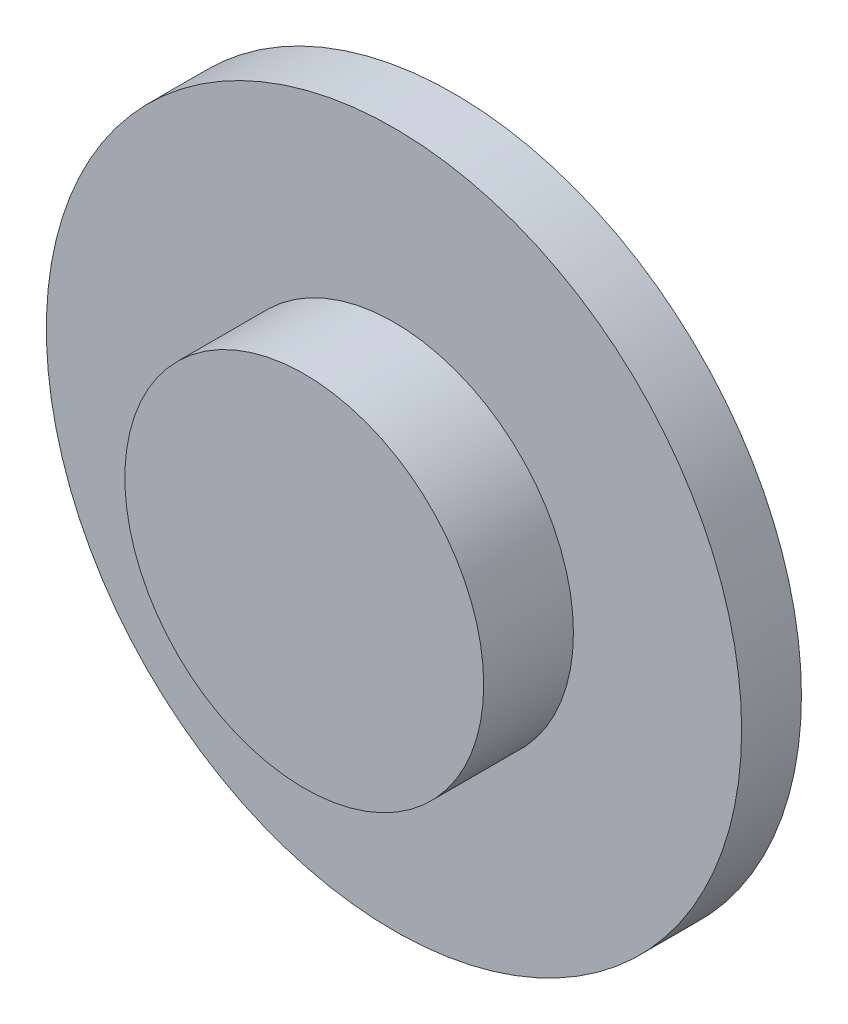
ISO-10303-21;
HEADER;
FILE_DESCRIPTION(('STEP AP214'),'2;1');
FILE_NAME('part.step','',(''),(''),'','','');
FILE_SCHEMA(('AUTOMOTIVE_DESIGN { 1 0 10303 214 1 1 1 1 }'));
ENDSEC;
DATA;
#1=APPLICATION_CONTEXT('core data for automotive mechanical design processes');
#2=APPLICATION_PROTOCOL_DEFINITION('international standard','automotive_design',2000,#1);
#3=PRODUCT_CONTEXT('',#1,'mechanical');
#4=PRODUCT('Part','Part','',(#3));
#5=PRODUCT_RELATED_PRODUCT_CATEGORY('part','',(#4));
#6=PRODUCT_DEFINITION_FORMATION('','',#4);
#7=PRODUCT_DEFINITION_CONTEXT('part definition',#1,'design');
#8=PRODUCT_DEFINITION('design','',#6,#7);
#9=PRODUCT_DEFINITION_SHAPE('','',#8);
#10=(LENGTH_UNIT() NAMED_UNIT(*) SI_UNIT(.MILLI.,.METRE.));
#11=(NAMED_UNIT(*) PLANE_ANGLE_UNIT() SI_UNIT($,.RADIAN.));
#12=(NAMED_UNIT(*) SI_UNIT($,.STERADIAN.) SOLID_ANGLE_UNIT());
#13=UNCERTAINTY_MEASURE_WITH_UNIT(LENGTH_MEASURE(1.E-05),#10,'distance_accuracy_value','');
#14=(GEOMETRIC_REPRESENTATION_CONTEXT(3) GLOBAL_UNCERTAINTY_ASSIGNED_CONTEXT((#13)) GLOBAL_UNIT_ASSIGNED_CONTEXT((#10,
#11,#12)) REPRESENTATION_CONTEXT('',''));
#15=CARTESIAN_POINT('',(0.,0.,0.));
#16=DIRECTION('',(0.,0.,1.));
#17=DIRECTION('',(1.,0.,0.));
#18=AXIS2_PLACEMENT_3D('',#15,#16,#17);
#19=CARTESIAN_POINT('',(0.,0.,8.));
#20=DIRECTION('',(0.,0.,-1.));
#21=DIRECTION('',(-1.,0.,0.));
#22=AXIS2_PLACEMENT_3D('',#19,#20,#21);
#23=CYLINDRICAL_SURFACE('',#22,46.5);
#24=CARTESIAN_POINT('',(0.,0.,8.));
#25=DIRECTION('',(0.,0.,-1.));
#26=DIRECTION('',(1.,0.,0.));
#27=AXIS2_PLACEMENT_3D('',#24,#25,#26);
#28=CIRCLE('',#27,46.5);
#29=CARTESIAN_POINT('',(46.5,0.,8.));
#30=VERTEX_POINT('',#29);
#31=EDGE_CURVE('E10',#30,#30,#28,.T.);
#32=ORIENTED_EDGE('',*,*,#31,.T.);
#33=EDGE_LOOP('',(#32));
#34=FACE_BOUND('',#33,.T.);
#35=CARTESIAN_POINT('',(0.,0.,0.));
#36=DIRECTION('',(0.,0.,-1.));
#37=DIRECTION('',(1.,0.,0.));
#38=AXIS2_PLACEMENT_3D('',#35,#36,#37);
#39=CIRCLE('',#38,46.5);
#40=CARTESIAN_POINT('',(46.5,0.,0.));
#41=VERTEX_POINT('',#40);
#42=EDGE_CURVE('E18',#41,#41,#39,.T.);
#43=ORIENTED_EDGE('',*,*,#42,.F.);
#44=EDGE_LOOP('',(#43));
#45=FACE_BOUND('',#44,.T.);
#46=ADVANCED_FACE('F15',(#34,#45),#23,.T.);
#47=CARTESIAN_POINT('',(0.,0.,8.));
#48=DIRECTION('',(0.,0.,-1.));
#49=DIRECTION('',(-1.,0.,0.));
#50=AXIS2_PLACEMENT_3D('',#47,#48,#49);
#51=PLANE('',#50);
#52=CARTESIAN_POINT('',(0.,0.,8.));
#53=DIRECTION('',(0.,0.,-1.));
#54=DIRECTION('',(1.,0.,0.));
#55=AXIS2_PLACEMENT_3D('',#52,#53,#54);
#56=CIRCLE('',#55,24.);
#57=CARTESIAN_POINT('',(24.,0.,8.));
#58=VERTEX_POINT('',#57);
#59=EDGE_CURVE('E28',#58,#58,#56,.T.);
#60=ORIENTED_EDGE('',*,*,#59,.T.);
#61=EDGE_LOOP('',(#60));
#62=FACE_BOUND('',#61,.T.);
#63=ORIENTED_EDGE('',*,*,#31,.F.);
#64=EDGE_LOOP('',(#63));
#65=FACE_BOUND('',#64,.T.);
#66=ADVANCED_FACE('F48',(#62,#65),#51,.F.);
#67=CARTESIAN_POINT('',(0.,0.,0.));
#68=DIRECTION('',(0.,0.,-1.));
#69=DIRECTION('',(-1.,0.,0.));
#70=AXIS2_PLACEMENT_3D('',#67,#68,#69);
#71=PLANE('',#70);
#72=ORIENTED_EDGE('',*,*,#42,.T.);
#73=EDGE_LOOP('',(#72));
#74=FACE_BOUND('',#73,.T.);
#75=ADVANCED_FACE('F45',(#74),#71,.T.);
#76=CARTESIAN_POINT('',(0.,0.,20.));
#77=DIRECTION('',(0.,0.,-1.));
#78=DIRECTION('',(-1.,0.,0.));
#79=AXIS2_PLACEMENT_3D('',#76,#77,#78);
#80=CYLINDRICAL_SURFACE('',#79,24.);
#81=CARTESIAN_POINT('',(0.,0.,20.));
#82=DIRECTION('',(0.,0.,-1.));
#83=DIRECTION('',(1.,0.,0.));
#84=AXIS2_PLACEMENT_3D('',#81,#82,#83);
#85=CIRCLE('',#84,24.);
#86=CARTESIAN_POINT('',(24.,0.,20.));
#87=VERTEX_POINT('',#86);
#88=EDGE_CURVE('E26',#87,#87,#85,.T.);
#89=ORIENTED_EDGE('',*,*,#88,.T.);
#90=EDGE_LOOP('',(#89));
#91=FACE_BOUND('',#90,.T.);
#92=ORIENTED_EDGE('',*,*,#59,.F.);
#93=EDGE_LOOP('',(#92));
#94=FACE_BOUND('',#93,.T.);
#95=ADVANCED_FACE('F35',(#91,#94),#80,.T.);
#96=CARTESIAN_POINT('',(0.,0.,20.));
#97=DIRECTION('',(0.,0.,-1.));
#98=DIRECTION('',(-1.,0.,0.));
#99=AXIS2_PLACEMENT_3D('',#96,#97,#98);
#100=PLANE('',#99);
#101=ORIENTED_EDGE('',*,*,#88,.F.);
#102=EDGE_LOOP('',(#101));
#103=FACE_BOUND('',#102,.T.);
#104=ADVANCED_FACE('F38',(#103),#100,.F.);
#105=CLOSED_SHELL('',(#46,#66,#75,#95,#104));
#106=MANIFOLD_SOLID_BREP('B1',#105);
#107=ADVANCED_BREP_SHAPE_REPRESENTATION('',(#18,#106),#14);
#108=SHAPE_DEFINITION_REPRESENTATION(#9,#107);
ENDSEC;
END-ISO-10303-21;
